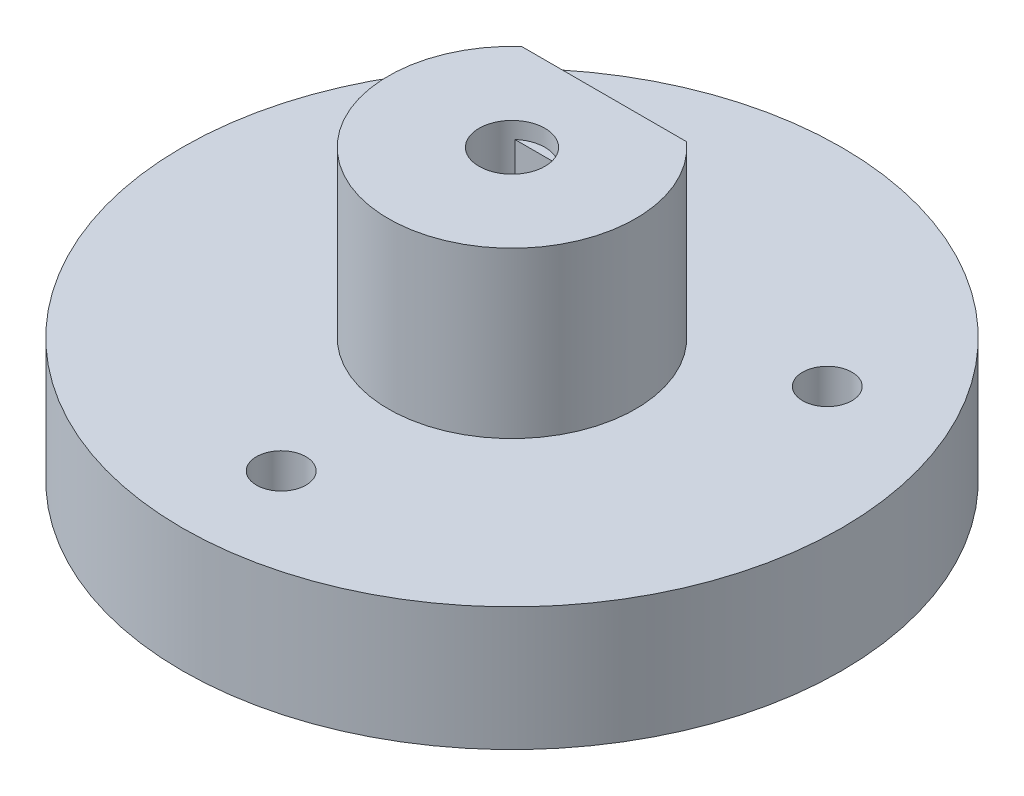
ISO-10303-21;
HEADER;
FILE_DESCRIPTION(('STEP AP214'),'2;1');
FILE_NAME('part.step','',(''),(''),'','','');
FILE_SCHEMA(('AUTOMOTIVE_DESIGN { 1 0 10303 214 1 1 1 1 }'));
ENDSEC;
DATA;
#1=APPLICATION_CONTEXT('core data for automotive mechanical design processes');
#2=APPLICATION_PROTOCOL_DEFINITION('international standard','automotive_design',2000,#1);
#3=PRODUCT_CONTEXT('',#1,'mechanical');
#4=PRODUCT('Part','Part','',(#3));
#5=PRODUCT_RELATED_PRODUCT_CATEGORY('part','',(#4));
#6=PRODUCT_DEFINITION_FORMATION('','',#4);
#7=PRODUCT_DEFINITION_CONTEXT('part definition',#1,'design');
#8=PRODUCT_DEFINITION('design','',#6,#7);
#9=PRODUCT_DEFINITION_SHAPE('','',#8);
#10=(LENGTH_UNIT() NAMED_UNIT(*) SI_UNIT(.MILLI.,.METRE.));
#11=(NAMED_UNIT(*) PLANE_ANGLE_UNIT() SI_UNIT($,.RADIAN.));
#12=(NAMED_UNIT(*) SI_UNIT($,.STERADIAN.) SOLID_ANGLE_UNIT());
#13=UNCERTAINTY_MEASURE_WITH_UNIT(LENGTH_MEASURE(1.E-05),#10,'distance_accuracy_value','');
#14=(GEOMETRIC_REPRESENTATION_CONTEXT(3) GLOBAL_UNCERTAINTY_ASSIGNED_CONTEXT((#13)) GLOBAL_UNIT_ASSIGNED_CONTEXT((#10,
#11,#12)) REPRESENTATION_CONTEXT('',''));
#15=CARTESIAN_POINT('',(0.,0.,0.));
#16=DIRECTION('',(0.,0.,1.));
#17=DIRECTION('',(1.,0.,0.));
#18=AXIS2_PLACEMENT_3D('',#15,#16,#17);
#19=CARTESIAN_POINT('',(-1.3228756555323,2.18492709363267,-1.5));
#20=DIRECTION('',(0.,0.,-1.));
#21=DIRECTION('',(-1.,0.,0.));
#22=AXIS2_PLACEMENT_3D('',#19,#20,#21);
#23=PLANE('',#22);
#24=DIRECTION('',(1.,0.,0.));
#25=VECTOR('',#24,1.);
#26=CARTESIAN_POINT('',(-1.3228756555323,16.5,-1.5));
#27=LINE('',#26,#25);
#28=CARTESIAN_POINT('',(-1.3228756555323,16.5,-1.5));
#29=VERTEX_POINT('',#28);
#30=CARTESIAN_POINT('',(1.3228756555323,16.5,-1.5));
#31=VERTEX_POINT('',#30);
#32=EDGE_CURVE('E130',#29,#31,#27,.T.);
#33=ORIENTED_EDGE('',*,*,#32,.F.);
#34=DIRECTION('',(0.,1.,0.));
#35=VECTOR('',#34,1.);
#36=CARTESIAN_POINT('',(-1.3228756555323,2.18492709363267,-1.5));
#37=LINE('',#36,#35);
#38=CARTESIAN_POINT('',(-1.32287565553229,13.8287682265918,-1.5));
#39=VERTEX_POINT('',#38);
#40=EDGE_CURVE('E146',#39,#29,#37,.T.);
#41=ORIENTED_EDGE('',*,*,#40,.F.);
#42=CARTESIAN_POINT('',(0.,12.5,-1.5));
#43=DIRECTION('',(0.,0.,-1.));
#44=DIRECTION('',(-1.,0.,0.));
#45=AXIS2_PLACEMENT_3D('',#42,#43,#44);
#46=CIRCLE('',#45,1.875);
#47=CARTESIAN_POINT('',(1.32287565553229,13.8287682265918,-1.5));
#48=VERTEX_POINT('',#47);
#49=EDGE_CURVE('E11',#39,#48,#46,.T.);
#50=ORIENTED_EDGE('',*,*,#49,.T.);
#51=DIRECTION('',(0.,1.,0.));
#52=VECTOR('',#51,1.);
#53=CARTESIAN_POINT('',(1.3228756555323,2.18492709363267,-1.5));
#54=LINE('',#53,#52);
#55=EDGE_CURVE('E145',#48,#31,#54,.T.);
#56=ORIENTED_EDGE('',*,*,#55,.T.);
#57=EDGE_LOOP('',(#33,#41,#50,#56));
#58=FACE_BOUND('',#57,.T.);
#59=ADVANCED_FACE('F39',(#58),#23,.F.);
#60=CARTESIAN_POINT('',(0.,7.5,0.));
#61=DIRECTION('',(0.,-1.,0.));
#62=DIRECTION('',(0.,0.,-1.));
#63=AXIS2_PLACEMENT_3D('',#60,#61,#62);
#64=CYLINDRICAL_SURFACE('',#63,20.);
#65=CARTESIAN_POINT('',(0.,7.5,0.));
#66=DIRECTION('',(0.,1.,0.));
#67=DIRECTION('',(0.,0.,1.));
#68=AXIS2_PLACEMENT_3D('',#65,#66,#67);
#69=CIRCLE('',#68,20.);
#70=CARTESIAN_POINT('',(0.,7.5,20.));
#71=VERTEX_POINT('',#70);
#72=EDGE_CURVE('E253',#71,#71,#69,.T.);
#73=ORIENTED_EDGE('',*,*,#72,.F.);
#74=EDGE_LOOP('',(#73));
#75=FACE_BOUND('',#74,.T.);
#76=CARTESIAN_POINT('',(0.,0.,0.));
#77=DIRECTION('',(0.,1.,0.));
#78=DIRECTION('',(0.,0.,1.));
#79=AXIS2_PLACEMENT_3D('',#76,#77,#78);
#80=CIRCLE('',#79,20.);
#81=CARTESIAN_POINT('',(0.,0.,20.));
#82=VERTEX_POINT('',#81);
#83=EDGE_CURVE('E248',#82,#82,#80,.T.);
#84=ORIENTED_EDGE('',*,*,#83,.T.);
#85=EDGE_LOOP('',(#84));
#86=FACE_BOUND('',#85,.T.);
#87=ADVANCED_FACE('F41',(#75,#86),#64,.T.);
#88=CARTESIAN_POINT('',(0.,7.5,0.));
#89=DIRECTION('',(0.,1.,0.));
#90=DIRECTION('',(0.,0.,1.));
#91=AXIS2_PLACEMENT_3D('',#88,#89,#90);
#92=PLANE('',#91);
#93=CARTESIAN_POINT('',(-12.1243556529822,7.5,-6.99999999999992));
#94=DIRECTION('',(0.,1.,0.));
#95=DIRECTION('',(0.,0.,1.));
#96=AXIS2_PLACEMENT_3D('',#93,#94,#95);
#97=CIRCLE('',#96,1.5);
#98=CARTESIAN_POINT('',(-12.1243556529822,7.5,-5.49999999999993));
#99=VERTEX_POINT('',#98);
#100=EDGE_CURVE('E265',#99,#99,#97,.T.);
#101=ORIENTED_EDGE('',*,*,#100,.F.);
#102=EDGE_LOOP('',(#101));
#103=FACE_BOUND('',#102,.T.);
#104=CARTESIAN_POINT('',(12.1243556529821,7.5,-7.00000000000154));
#105=DIRECTION('',(0.,1.,0.));
#106=DIRECTION('',(0.,0.,1.));
#107=AXIS2_PLACEMENT_3D('',#104,#105,#106);
#108=CIRCLE('',#107,1.5);
#109=CARTESIAN_POINT('',(12.1243556529821,7.5,-5.50000000000154));
#110=VERTEX_POINT('',#109);
#111=EDGE_CURVE('E542',#110,#110,#108,.T.);
#112=ORIENTED_EDGE('',*,*,#111,.F.);
#113=EDGE_LOOP('',(#112));
#114=FACE_BOUND('',#113,.T.);
#115=CARTESIAN_POINT('',(1.36099323779789E-12,7.5,13.9999999999993));
#116=DIRECTION('',(0.,1.,0.));
#117=DIRECTION('',(0.,0.,1.));
#118=AXIS2_PLACEMENT_3D('',#115,#116,#117);
#119=CIRCLE('',#118,1.49999999999999);
#120=CARTESIAN_POINT('',(1.36099323779789E-12,7.5,15.4999999999993));
#121=VERTEX_POINT('',#120);
#122=EDGE_CURVE('E139',#121,#121,#119,.T.);
#123=ORIENTED_EDGE('',*,*,#122,.F.);
#124=EDGE_LOOP('',(#123));
#125=FACE_BOUND('',#124,.T.);
#126=CARTESIAN_POINT('',(0.,7.5,0.));
#127=DIRECTION('',(0.,1.,0.));
#128=DIRECTION('',(0.,0.,1.));
#129=AXIS2_PLACEMENT_3D('',#126,#127,#128);
#130=CIRCLE('',#129,7.5);
#131=CARTESIAN_POINT('',(-5.,7.5,-5.59016994374947));
#132=VERTEX_POINT('',#131);
#133=CARTESIAN_POINT('',(5.,7.5,-5.59016994374947));
#134=VERTEX_POINT('',#133);
#135=EDGE_CURVE('E249',#132,#134,#130,.T.);
#136=ORIENTED_EDGE('',*,*,#135,.F.);
#137=DIRECTION('',(1.,0.,0.));
#138=VECTOR('',#137,1.);
#139=CARTESIAN_POINT('',(-5.,7.5,-5.59016994374947));
#140=LINE('',#139,#138);
#141=EDGE_CURVE('E231',#132,#134,#140,.T.);
#142=ORIENTED_EDGE('',*,*,#141,.T.);
#143=EDGE_LOOP('',(#136,#142));
#144=FACE_BOUND('',#143,.T.);
#145=ORIENTED_EDGE('',*,*,#72,.T.);
#146=EDGE_LOOP('',(#145));
#147=FACE_BOUND('',#146,.T.);
#148=ADVANCED_FACE('F322',(#103,#114,#125,#144,#147),#92,.T.);
#149=CARTESIAN_POINT('',(0.,0.,0.));
#150=DIRECTION('',(0.,1.,0.));
#151=DIRECTION('',(0.,0.,1.));
#152=AXIS2_PLACEMENT_3D('',#149,#150,#151);
#153=PLANE('',#152);
#154=CARTESIAN_POINT('',(-12.1243556529822,0.,-6.99999999999992));
#155=DIRECTION('',(0.,1.,0.));
#156=DIRECTION('',(0.,0.,1.));
#157=AXIS2_PLACEMENT_3D('',#154,#155,#156);
#158=CIRCLE('',#157,1.5);
#159=CARTESIAN_POINT('',(-12.1243556529822,0.,-5.49999999999993));
#160=VERTEX_POINT('',#159);
#161=EDGE_CURVE('E43',#160,#160,#158,.T.);
#162=ORIENTED_EDGE('',*,*,#161,.T.);
#163=EDGE_LOOP('',(#162));
#164=FACE_BOUND('',#163,.T.);
#165=CARTESIAN_POINT('',(12.1243556529821,0.,-7.00000000000154));
#166=DIRECTION('',(0.,1.,0.));
#167=DIRECTION('',(0.,0.,1.));
#168=AXIS2_PLACEMENT_3D('',#165,#166,#167);
#169=CIRCLE('',#168,1.5);
#170=CARTESIAN_POINT('',(12.1243556529821,0.,-5.50000000000154));
#171=VERTEX_POINT('',#170);
#172=EDGE_CURVE('E264',#171,#171,#169,.T.);
#173=ORIENTED_EDGE('',*,*,#172,.T.);
#174=EDGE_LOOP('',(#173));
#175=FACE_BOUND('',#174,.T.);
#176=CARTESIAN_POINT('',(1.36099323779789E-12,0.,13.9999999999993));
#177=DIRECTION('',(0.,1.,0.));
#178=DIRECTION('',(0.,0.,1.));
#179=AXIS2_PLACEMENT_3D('',#176,#177,#178);
#180=CIRCLE('',#179,1.49999999999999);
#181=CARTESIAN_POINT('',(1.36099323779789E-12,0.,15.4999999999993));
#182=VERTEX_POINT('',#181);
#183=EDGE_CURVE('E261',#182,#182,#180,.T.);
#184=ORIENTED_EDGE('',*,*,#183,.T.);
#185=EDGE_LOOP('',(#184));
#186=FACE_BOUND('',#185,.T.);
#187=ORIENTED_EDGE('',*,*,#83,.F.);
#188=EDGE_LOOP('',(#187));
#189=FACE_BOUND('',#188,.T.);
#190=ADVANCED_FACE('F327',(#164,#175,#186,#189),#153,.F.);
#191=CARTESIAN_POINT('',(0.,17.5,0.));
#192=DIRECTION('',(0.,-1.,0.));
#193=DIRECTION('',(0.,0.,-1.));
#194=AXIS2_PLACEMENT_3D('',#191,#192,#193);
#195=CYLINDRICAL_SURFACE('',#194,7.5);
#196=CARTESIAN_POINT('',(0.,17.5,0.));
#197=DIRECTION('',(0.,1.,0.));
#198=DIRECTION('',(0.,0.,1.));
#199=AXIS2_PLACEMENT_3D('',#196,#197,#198);
#200=CIRCLE('',#199,7.5);
#201=CARTESIAN_POINT('',(-5.,17.5,-5.59016994374947));
#202=VERTEX_POINT('',#201);
#203=CARTESIAN_POINT('',(5.,17.5,-5.59016994374947));
#204=VERTEX_POINT('',#203);
#205=EDGE_CURVE('E242',#202,#204,#200,.T.);
#206=ORIENTED_EDGE('',*,*,#205,.F.);
#207=DIRECTION('',(0.,1.,0.));
#208=VECTOR('',#207,1.);
#209=CARTESIAN_POINT('',(-5.,7.5,-5.59016994374947));
#210=LINE('',#209,#208);
#211=EDGE_CURVE('E235',#132,#202,#210,.T.);
#212=ORIENTED_EDGE('',*,*,#211,.F.);
#213=ORIENTED_EDGE('',*,*,#135,.T.);
#214=DIRECTION('',(0.,1.,0.));
#215=VECTOR('',#214,1.);
#216=CARTESIAN_POINT('',(5.,7.5,-5.59016994374947));
#217=LINE('',#216,#215);
#218=EDGE_CURVE('E238',#134,#204,#217,.T.);
#219=ORIENTED_EDGE('',*,*,#218,.T.);
#220=EDGE_LOOP('',(#206,#212,#213,#219));
#221=FACE_BOUND('',#220,.T.);
#222=ADVANCED_FACE('F335',(#221),#195,.T.);
#223=CARTESIAN_POINT('',(0.,17.5,0.));
#224=DIRECTION('',(0.,1.,0.));
#225=DIRECTION('',(0.,0.,1.));
#226=AXIS2_PLACEMENT_3D('',#223,#224,#225);
#227=PLANE('',#226);
#228=CARTESIAN_POINT('',(0.,17.5,0.));
#229=DIRECTION('',(0.,1.,0.));
#230=DIRECTION('',(0.,0.,1.));
#231=AXIS2_PLACEMENT_3D('',#228,#229,#230);
#232=CIRCLE('',#231,2.);
#233=CARTESIAN_POINT('',(0.,17.5,2.));
#234=VERTEX_POINT('',#233);
#235=EDGE_CURVE('E151',#234,#234,#232,.T.);
#236=ORIENTED_EDGE('',*,*,#235,.F.);
#237=EDGE_LOOP('',(#236));
#238=FACE_BOUND('',#237,.T.);
#239=DIRECTION('',(1.,0.,0.));
#240=VECTOR('',#239,1.);
#241=CARTESIAN_POINT('',(-5.,17.5,-5.59016994374947));
#242=LINE('',#241,#240);
#243=EDGE_CURVE('E216',#202,#204,#242,.T.);
#244=ORIENTED_EDGE('',*,*,#243,.F.);
#245=ORIENTED_EDGE('',*,*,#205,.T.);
#246=EDGE_LOOP('',(#244,#245));
#247=FACE_BOUND('',#246,.T.);
#248=ADVANCED_FACE('F339',(#238,#247),#227,.T.);
#249=CARTESIAN_POINT('',(-5.,7.5,-5.59016994374947));
#250=DIRECTION('',(0.,0.,1.));
#251=DIRECTION('',(1.,0.,0.));
#252=AXIS2_PLACEMENT_3D('',#249,#250,#251);
#253=PLANE('',#252);
#254=DIRECTION('',(-0.866025403784439,0.499999999999999,0.));
#255=VECTOR('',#254,1.);
#256=CARTESIAN_POINT('',(0.,8.45854811567262,-5.59016994374947));
#257=LINE('',#256,#255);
#258=CARTESIAN_POINT('',(0.,8.45854811567262,-5.59016994374947));
#259=VERTEX_POINT('',#258);
#260=CARTESIAN_POINT('',(-3.5,10.4792740578363,-5.59016994374947));
#261=VERTEX_POINT('',#260);
#262=EDGE_CURVE('E194',#259,#261,#257,.T.);
#263=ORIENTED_EDGE('',*,*,#262,.F.);
#264=DIRECTION('',(-0.866025403784438,-0.500000000000001,0.));
#265=VECTOR('',#264,1.);
#266=CARTESIAN_POINT('',(3.50000000000001,10.4792740578363,-5.59016994374947));
#267=LINE('',#266,#265);
#268=CARTESIAN_POINT('',(3.50000000000001,10.4792740578363,-5.59016994374947));
#269=VERTEX_POINT('',#268);
#270=EDGE_CURVE('E65',#269,#259,#267,.T.);
#271=ORIENTED_EDGE('',*,*,#270,.F.);
#272=DIRECTION('',(0.,-1.,0.));
#273=VECTOR('',#272,1.);
#274=CARTESIAN_POINT('',(3.5,14.5207259421637,-5.59016994374947));
#275=LINE('',#274,#273);
#276=CARTESIAN_POINT('',(3.5,14.5207259421637,-5.59016994374947));
#277=VERTEX_POINT('',#276);
#278=EDGE_CURVE('E171',#277,#269,#275,.T.);
#279=ORIENTED_EDGE('',*,*,#278,.F.);
#280=DIRECTION('',(0.866025403784439,-0.499999999999999,0.));
#281=VECTOR('',#280,1.);
#282=CARTESIAN_POINT('',(0.,16.5414518843274,-5.59016994374947));
#283=LINE('',#282,#281);
#284=CARTESIAN_POINT('',(0.,16.5414518843274,-5.59016994374947));
#285=VERTEX_POINT('',#284);
#286=EDGE_CURVE('E206',#285,#277,#283,.T.);
#287=ORIENTED_EDGE('',*,*,#286,.F.);
#288=DIRECTION('',(0.866025403784438,0.500000000000001,0.));
#289=VECTOR('',#288,1.);
#290=CARTESIAN_POINT('',(-3.5,14.5207259421637,-5.59016994374947));
#291=LINE('',#290,#289);
#292=CARTESIAN_POINT('',(-3.5,14.5207259421637,-5.59016994374947));
#293=VERTEX_POINT('',#292);
#294=EDGE_CURVE('E202',#293,#285,#291,.T.);
#295=ORIENTED_EDGE('',*,*,#294,.F.);
#296=DIRECTION('',(0.,1.,0.));
#297=VECTOR('',#296,1.);
#298=CARTESIAN_POINT('',(-3.5,10.4792740578363,-5.59016994374947));
#299=LINE('',#298,#297);
#300=EDGE_CURVE('E198',#261,#293,#299,.T.);
#301=ORIENTED_EDGE('',*,*,#300,.F.);
#302=EDGE_LOOP('',(#263,#271,#279,#287,#295,#301));
#303=FACE_BOUND('',#302,.T.);
#304=ORIENTED_EDGE('',*,*,#243,.T.);
#305=ORIENTED_EDGE('',*,*,#218,.F.);
#306=ORIENTED_EDGE('',*,*,#141,.F.);
#307=ORIENTED_EDGE('',*,*,#211,.T.);
#308=EDGE_LOOP('',(#304,#305,#306,#307));
#309=FACE_BOUND('',#308,.T.);
#310=ADVANCED_FACE('F345',(#303,#309),#253,.F.);
#311=CARTESIAN_POINT('',(3.50000000000001,10.4792740578363,-2.59016994374947));
#312=DIRECTION('',(0.500000000000001,-0.866025403784438,0.));
#313=DIRECTION('',(0.866025403784438,0.500000000000001,0.));
#314=AXIS2_PLACEMENT_3D('',#311,#312,#313);
#315=PLANE('',#314);
#316=ORIENTED_EDGE('',*,*,#270,.T.);
#317=DIRECTION('',(0.,0.,-1.));
#318=VECTOR('',#317,1.);
#319=CARTESIAN_POINT('',(0.,8.45854811567262,-2.59016994374947));
#320=LINE('',#319,#318);
#321=CARTESIAN_POINT('',(0.,8.45854811567262,-2.59016994374947));
#322=VERTEX_POINT('',#321);
#323=EDGE_CURVE('E191',#322,#259,#320,.T.);
#324=ORIENTED_EDGE('',*,*,#323,.F.);
#325=DIRECTION('',(-0.866025403784438,-0.500000000000001,0.));
#326=VECTOR('',#325,1.);
#327=CARTESIAN_POINT('',(3.50000000000001,10.4792740578363,-2.59016994374947));
#328=LINE('',#327,#326);
#329=CARTESIAN_POINT('',(3.50000000000001,10.4792740578363,-2.59016994374947));
#330=VERTEX_POINT('',#329);
#331=EDGE_CURVE('E166',#330,#322,#328,.T.);
#332=ORIENTED_EDGE('',*,*,#331,.F.);
#333=DIRECTION('',(0.,0.,-1.));
#334=VECTOR('',#333,1.);
#335=CARTESIAN_POINT('',(3.50000000000001,10.4792740578363,-2.59016994374947));
#336=LINE('',#335,#334);
#337=EDGE_CURVE('E213',#330,#269,#336,.T.);
#338=ORIENTED_EDGE('',*,*,#337,.T.);
#339=EDGE_LOOP('',(#316,#324,#332,#338));
#340=FACE_BOUND('',#339,.T.);
#341=ADVANCED_FACE('F349',(#340),#315,.F.);
#342=CARTESIAN_POINT('',(3.5,14.5207259421637,-2.59016994374947));
#343=DIRECTION('',(1.,0.,0.));
#344=DIRECTION('',(0.,1.,0.));
#345=AXIS2_PLACEMENT_3D('',#342,#343,#344);
#346=PLANE('',#345);
#347=ORIENTED_EDGE('',*,*,#278,.T.);
#348=ORIENTED_EDGE('',*,*,#337,.F.);
#349=DIRECTION('',(0.,-1.,0.));
#350=VECTOR('',#349,1.);
#351=CARTESIAN_POINT('',(3.5,14.5207259421637,-2.59016994374947));
#352=LINE('',#351,#350);
#353=CARTESIAN_POINT('',(3.5,14.5207259421637,-2.59016994374947));
#354=VERTEX_POINT('',#353);
#355=EDGE_CURVE('E187',#354,#330,#352,.T.);
#356=ORIENTED_EDGE('',*,*,#355,.F.);
#357=DIRECTION('',(0.,0.,-1.));
#358=VECTOR('',#357,1.);
#359=CARTESIAN_POINT('',(3.5,14.5207259421637,-2.59016994374947));
#360=LINE('',#359,#358);
#361=EDGE_CURVE('E217',#354,#277,#360,.T.);
#362=ORIENTED_EDGE('',*,*,#361,.T.);
#363=EDGE_LOOP('',(#347,#348,#356,#362));
#364=FACE_BOUND('',#363,.T.);
#365=ADVANCED_FACE('F353',(#364),#346,.F.);
#366=CARTESIAN_POINT('',(0.,16.5414518843274,-2.59016994374947));
#367=DIRECTION('',(0.5,0.866025403784439,0.));
#368=DIRECTION('',(-0.866025403784439,0.5,0.));
#369=AXIS2_PLACEMENT_3D('',#366,#367,#368);
#370=PLANE('',#369);
#371=ORIENTED_EDGE('',*,*,#286,.T.);
#372=ORIENTED_EDGE('',*,*,#361,.F.);
#373=DIRECTION('',(0.866025403784439,-0.499999999999999,0.));
#374=VECTOR('',#373,1.);
#375=CARTESIAN_POINT('',(0.,16.5414518843274,-2.59016994374947));
#376=LINE('',#375,#374);
#377=CARTESIAN_POINT('',(0.,16.5414518843274,-2.59016994374947));
#378=VERTEX_POINT('',#377);
#379=EDGE_CURVE('E183',#378,#354,#376,.T.);
#380=ORIENTED_EDGE('',*,*,#379,.F.);
#381=DIRECTION('',(0.,0.,-1.));
#382=VECTOR('',#381,1.);
#383=CARTESIAN_POINT('',(0.,16.5414518843274,-2.59016994374947));
#384=LINE('',#383,#382);
#385=EDGE_CURVE('E220',#378,#285,#384,.T.);
#386=ORIENTED_EDGE('',*,*,#385,.T.);
#387=EDGE_LOOP('',(#371,#372,#380,#386));
#388=FACE_BOUND('',#387,.T.);
#389=ADVANCED_FACE('F365',(#388),#370,.F.);
#390=CARTESIAN_POINT('',(-3.5,14.5207259421637,-2.59016994374947));
#391=DIRECTION('',(-0.500000000000001,0.866025403784438,0.));
#392=DIRECTION('',(-0.866025403784438,-0.500000000000001,0.));
#393=AXIS2_PLACEMENT_3D('',#390,#391,#392);
#394=PLANE('',#393);
#395=ORIENTED_EDGE('',*,*,#294,.T.);
#396=ORIENTED_EDGE('',*,*,#385,.F.);
#397=DIRECTION('',(0.866025403784438,0.500000000000001,0.));
#398=VECTOR('',#397,1.);
#399=CARTESIAN_POINT('',(-3.5,14.5207259421637,-2.59016994374947));
#400=LINE('',#399,#398);
#401=CARTESIAN_POINT('',(-3.5,14.5207259421637,-2.59016994374947));
#402=VERTEX_POINT('',#401);
#403=EDGE_CURVE('E179',#402,#378,#400,.T.);
#404=ORIENTED_EDGE('',*,*,#403,.F.);
#405=DIRECTION('',(0.,0.,-1.));
#406=VECTOR('',#405,1.);
#407=CARTESIAN_POINT('',(-3.5,14.5207259421637,-2.59016994374947));
#408=LINE('',#407,#406);
#409=EDGE_CURVE('E223',#402,#293,#408,.T.);
#410=ORIENTED_EDGE('',*,*,#409,.T.);
#411=EDGE_LOOP('',(#395,#396,#404,#410));
#412=FACE_BOUND('',#411,.T.);
#413=ADVANCED_FACE('F361',(#412),#394,.F.);
#414=CARTESIAN_POINT('',(-3.5,10.4792740578363,-2.59016994374947));
#415=DIRECTION('',(-1.,0.,0.));
#416=DIRECTION('',(0.,-1.,0.));
#417=AXIS2_PLACEMENT_3D('',#414,#415,#416);
#418=PLANE('',#417);
#419=ORIENTED_EDGE('',*,*,#300,.T.);
#420=ORIENTED_EDGE('',*,*,#409,.F.);
#421=DIRECTION('',(0.,1.,0.));
#422=VECTOR('',#421,1.);
#423=CARTESIAN_POINT('',(-3.5,10.4792740578363,-2.59016994374947));
#424=LINE('',#423,#422);
#425=CARTESIAN_POINT('',(-3.5,10.4792740578363,-2.59016994374947));
#426=VERTEX_POINT('',#425);
#427=EDGE_CURVE('E175',#426,#402,#424,.T.);
#428=ORIENTED_EDGE('',*,*,#427,.F.);
#429=DIRECTION('',(0.,0.,-1.));
#430=VECTOR('',#429,1.);
#431=CARTESIAN_POINT('',(-3.5,10.4792740578363,-2.59016994374947));
#432=LINE('',#431,#430);
#433=EDGE_CURVE('E226',#426,#261,#432,.T.);
#434=ORIENTED_EDGE('',*,*,#433,.T.);
#435=EDGE_LOOP('',(#419,#420,#428,#434));
#436=FACE_BOUND('',#435,.T.);
#437=ADVANCED_FACE('F357',(#436),#418,.F.);
#438=CARTESIAN_POINT('',(0.,8.45854811567262,-2.59016994374947));
#439=DIRECTION('',(-0.499999999999999,-0.866025403784439,0.));
#440=DIRECTION('',(0.866025403784439,-0.499999999999999,0.));
#441=AXIS2_PLACEMENT_3D('',#438,#439,#440);
#442=PLANE('',#441);
#443=ORIENTED_EDGE('',*,*,#262,.T.);
#444=ORIENTED_EDGE('',*,*,#433,.F.);
#445=DIRECTION('',(-0.866025403784439,0.499999999999999,0.));
#446=VECTOR('',#445,1.);
#447=CARTESIAN_POINT('',(0.,8.45854811567262,-2.59016994374947));
#448=LINE('',#447,#446);
#449=EDGE_CURVE('E170',#322,#426,#448,.T.);
#450=ORIENTED_EDGE('',*,*,#449,.F.);
#451=ORIENTED_EDGE('',*,*,#323,.T.);
#452=EDGE_LOOP('',(#443,#444,#450,#451));
#453=FACE_BOUND('',#452,.T.);
#454=ADVANCED_FACE('F354',(#453),#442,.F.);
#455=CARTESIAN_POINT('',(0.,0.,-2.59016994374947));
#456=DIRECTION('',(0.,0.,-1.));
#457=DIRECTION('',(-1.,0.,0.));
#458=AXIS2_PLACEMENT_3D('',#455,#456,#457);
#459=PLANE('',#458);
#460=CARTESIAN_POINT('',(0.,12.5,-2.59016994374947));
#461=DIRECTION('',(0.,0.,-1.));
#462=DIRECTION('',(-1.,0.,0.));
#463=AXIS2_PLACEMENT_3D('',#460,#461,#462);
#464=CIRCLE('',#463,1.875);
#465=CARTESIAN_POINT('',(-1.875,12.5,-2.59016994374947));
#466=VERTEX_POINT('',#465);
#467=EDGE_CURVE('E272',#466,#466,#464,.T.);
#468=ORIENTED_EDGE('',*,*,#467,.F.);
#469=EDGE_LOOP('',(#468));
#470=FACE_BOUND('',#469,.T.);
#471=ORIENTED_EDGE('',*,*,#331,.T.);
#472=ORIENTED_EDGE('',*,*,#449,.T.);
#473=ORIENTED_EDGE('',*,*,#427,.T.);
#474=ORIENTED_EDGE('',*,*,#403,.T.);
#475=ORIENTED_EDGE('',*,*,#379,.T.);
#476=ORIENTED_EDGE('',*,*,#355,.T.);
#477=EDGE_LOOP('',(#471,#472,#473,#474,#475,#476));
#478=FACE_BOUND('',#477,.T.);
#479=ADVANCED_FACE('F316',(#470,#478),#459,.T.);
#480=CARTESIAN_POINT('',(0.,2.18492709363267,0.));
#481=DIRECTION('',(0.,1.,0.));
#482=DIRECTION('',(0.,0.,1.));
#483=AXIS2_PLACEMENT_3D('',#480,#481,#482);
#484=CYLINDRICAL_SURFACE('',#483,2.);
#485=ORIENTED_EDGE('',*,*,#235,.T.);
#486=EDGE_LOOP('',(#485));
#487=FACE_BOUND('',#486,.T.);
#488=ORIENTED_EDGE('',*,*,#40,.T.);
#489=CARTESIAN_POINT('',(0.,16.5,0.));
#490=DIRECTION('',(0.,1.,0.));
#491=DIRECTION('',(0.,0.,1.));
#492=AXIS2_PLACEMENT_3D('',#489,#490,#491);
#493=CIRCLE('',#492,2.);
#494=EDGE_CURVE('E133',#31,#29,#493,.T.);
#495=ORIENTED_EDGE('',*,*,#494,.F.);
#496=ORIENTED_EDGE('',*,*,#55,.F.);
#497=CARTESIAN_POINT('',(1.32287565553229,13.8287682265918,-1.5));
#498=CARTESIAN_POINT('',(1.37053828223241,13.7812643063997,-1.45797719405252));
#499=CARTESIAN_POINT('',(1.41507707968952,13.7318641139541,-1.41465042667909));
#500=CARTESIAN_POINT('',(1.49812561260594,13.6294385235822,-1.32638041172368));
#501=CARTESIAN_POINT('',(1.53662949715042,13.5764096783031,-1.28143564674255));
#502=CARTESIAN_POINT('',(1.60818088890621,13.4663013053375,-1.19043979034085));
#503=CARTESIAN_POINT('',(1.6411540223503,13.4091793650433,-1.14438189289642));
#504=CARTESIAN_POINT('',(1.70113678206955,13.291288854324,-1.05313766443209));
#505=CARTESIAN_POINT('',(1.72815186791995,13.2305236878184,-1.00795057041357));
#506=CARTESIAN_POINT('',(1.77083875706235,13.1184718806861,-0.930395167611206));
#507=CARTESIAN_POINT('',(1.78769758019431,13.0680696972913,-0.897405583033618));
#508=CARTESIAN_POINT('',(1.81752995044654,12.9638384627507,-0.835319004736626));
#509=CARTESIAN_POINT('',(1.83051059794207,12.910015895757,-0.806214951911342));
#510=CARTESIAN_POINT('',(1.84902739261948,12.8136953792487,-0.76256005458334));
#511=CARTESIAN_POINT('',(1.85563026472134,12.7722407262571,-0.74621556148205));
#512=CARTESIAN_POINT('',(1.86612571083644,12.6871420618842,-0.719571745767211));
#513=CARTESIAN_POINT('',(1.87002772436288,12.6435062530599,-0.709251388796148));
#514=CARTESIAN_POINT('',(1.87438138916011,12.5612928351613,-0.697660250817065));
#515=CARTESIAN_POINT('',(1.87525118775515,12.5228988522031,-0.695294568143516));
#516=CARTESIAN_POINT('',(1.87462212156375,12.4462764096833,-0.696987789652035));
#517=CARTESIAN_POINT('',(1.87312288926745,12.4080479767262,-0.701047690640759));
#518=CARTESIAN_POINT('',(1.86712264621733,12.3214053421594,-0.71689675114061));
#519=CARTESIAN_POINT('',(1.86184876272713,12.2734206350637,-0.730657599406197));
#520=CARTESIAN_POINT('',(1.84813435216521,12.180204508786,-0.764676888124884));
#521=CARTESIAN_POINT('',(1.83967828961884,12.1349878835646,-0.784967133675177));
#522=CARTESIAN_POINT('',(1.81978409532719,12.0459660060591,-0.830067102031584));
#523=CARTESIAN_POINT('',(1.80826891374077,12.0022360076143,-0.854987707330137));
#524=CARTESIAN_POINT('',(1.78262424631307,11.9170298398421,-0.907251302291443));
#525=CARTESIAN_POINT('',(1.76849191350137,11.8755561891797,-0.934596912860052));
#526=CARTESIAN_POINT('',(1.72231117773692,11.7537833231121,-1.01868012426052));
#527=CARTESIAN_POINT('',(1.68650544861684,11.6762446774125,-1.07739958396639));
#528=CARTESIAN_POINT('',(1.62436267925403,11.5624206296179,-1.16743022860063));
#529=CARTESIAN_POINT('',(1.60156139961704,11.5239749154777,-1.19856404858635));
#530=CARTESIAN_POINT('',(1.55317691077656,11.4486804678315,-1.26062813495217));
#531=CARTESIAN_POINT('',(1.52759361051076,11.4118317866555,-1.29155839463409));
#532=CARTESIAN_POINT('',(1.47380476992711,11.340033903049,-1.3526064683046));
#533=CARTESIAN_POINT('',(1.44562069404987,11.3050723673009,-1.38272867689846));
#534=CARTESIAN_POINT('',(1.38640110847743,11.2368486035011,-1.4420991980774));
#535=CARTESIAN_POINT('',(1.35536498898132,11.2035867412364,-1.47134732199292));
#536=CARTESIAN_POINT('',(1.32287565553229,11.1712317734082,-1.5));
#537=B_SPLINE_CURVE_WITH_KNOTS('',3,(#497,#498,#499,#500,#501,#502,#503,#504,#505,#506,#507,
#508,#509,#510,#511,#512,#513,#514,#515,#516,#517,#518,#519,#520,#521,#522,#523,#524,#525,#526,
#527,#528,#529,#530,#531,#532,#533,#534,#535,#536),.UNSPECIFIED.,.F.,.F.,(4,2,2,2,2,2,2,2,2,2,2,
2,2,2,2,2,2,2,2,4),(0.,0.237842970957552,0.475915125664067,0.716968849355863,0.957800760453072,
1.14525148542453,1.33235688211981,1.46712750358024,1.60142468985233,1.71625546537332,
1.83110405644341,1.98080538644243,2.13124724833316,2.28591236734963,2.44074673202184,
2.75080925407163,2.91416557774578,3.07752725008055,3.23964424246999,3.40179597841453),.UNSPECIFIED.);
#538=CARTESIAN_POINT('',(1.3228756555323,11.1712317734082,-1.5));
#539=VERTEX_POINT('',#538);
#540=EDGE_CURVE('E157',#48,#539,#537,.T.);
#541=ORIENTED_EDGE('',*,*,#540,.T.);
#542=CARTESIAN_POINT('',(1.32287565553229,7.5,-1.5));
#543=VERTEX_POINT('',#542);
#544=EDGE_CURVE('E150',#543,#539,#54,.T.);
#545=ORIENTED_EDGE('',*,*,#544,.F.);
#546=CARTESIAN_POINT('',(0.,7.5,0.));
#547=DIRECTION('',(0.,1.,0.));
#548=DIRECTION('',(0.,0.,1.));
#549=AXIS2_PLACEMENT_3D('',#546,#547,#548);
#550=CIRCLE('',#549,2.);
#551=CARTESIAN_POINT('',(-1.3228756555323,7.5,-1.5));
#552=VERTEX_POINT('',#551);
#553=EDGE_CURVE('E165',#543,#552,#550,.F.);
#554=ORIENTED_EDGE('',*,*,#553,.T.);
#555=CARTESIAN_POINT('',(-1.3228756555323,11.1712317734082,-1.5));
#556=VERTEX_POINT('',#555);
#557=EDGE_CURVE('E161',#552,#556,#37,.T.);
#558=ORIENTED_EDGE('',*,*,#557,.T.);
#559=CARTESIAN_POINT('',(-1.32287565553229,11.1712317734082,-1.5));
#560=CARTESIAN_POINT('',(-1.37053828223241,11.2187356936003,-1.45797719405252));
#561=CARTESIAN_POINT('',(-1.41507707968952,11.2681358860459,-1.41465042667909));
#562=CARTESIAN_POINT('',(-1.49812561260594,11.3705614764178,-1.32638041172368));
#563=CARTESIAN_POINT('',(-1.53662949715042,11.4235903216969,-1.28143564674255));
#564=CARTESIAN_POINT('',(-1.60818088890621,11.5336986946625,-1.19043979034085));
#565=CARTESIAN_POINT('',(-1.6411540223503,11.5908206349566,-1.14438189289642));
#566=CARTESIAN_POINT('',(-1.70113678206955,11.708711145676,-1.05313766443209));
#567=CARTESIAN_POINT('',(-1.72815186791995,11.7694763121816,-1.00795057041357));
#568=CARTESIAN_POINT('',(-1.77083875706235,11.8815281193139,-0.930395167611206));
#569=CARTESIAN_POINT('',(-1.78769758019431,11.9319303027087,-0.897405583033618));
#570=CARTESIAN_POINT('',(-1.81752995044654,12.0361615372493,-0.835319004736626));
#571=CARTESIAN_POINT('',(-1.83051059794207,12.089984104243,-0.806214951911342));
#572=CARTESIAN_POINT('',(-1.84902739261948,12.1863046207513,-0.76256005458334));
#573=CARTESIAN_POINT('',(-1.85563026472134,12.2277592737429,-0.74621556148205));
#574=CARTESIAN_POINT('',(-1.86612571083644,12.3128579381158,-0.719571745767211));
#575=CARTESIAN_POINT('',(-1.87002772436288,12.3564937469401,-0.709251388796147));
#576=CARTESIAN_POINT('',(-1.87438138916011,12.4387071648387,-0.697660250817064));
#577=CARTESIAN_POINT('',(-1.87525118775515,12.4771011477969,-0.695294568143516));
#578=CARTESIAN_POINT('',(-1.87462212156375,12.5537235903167,-0.696987789652036));
#579=CARTESIAN_POINT('',(-1.87312288926745,12.5919520232738,-0.70104769064076));
#580=CARTESIAN_POINT('',(-1.86712264621733,12.6785946578406,-0.716896751140611));
#581=CARTESIAN_POINT('',(-1.86184876272713,12.7265793649363,-0.730657599406198));
#582=CARTESIAN_POINT('',(-1.84813435216521,12.819795491214,-0.764676888124885));
#583=CARTESIAN_POINT('',(-1.83967828961884,12.8650121164354,-0.784967133675177));
#584=CARTESIAN_POINT('',(-1.81978409532719,12.9540339939409,-0.830067102031584));
#585=CARTESIAN_POINT('',(-1.80826891374077,12.9977639923857,-0.854987707330137));
#586=CARTESIAN_POINT('',(-1.78262424631307,13.0829701601579,-0.907251302291442));
#587=CARTESIAN_POINT('',(-1.76849191350137,13.1244438108203,-0.934596912860051));
#588=CARTESIAN_POINT('',(-1.72231117773692,13.2462166768879,-1.01868012426052));
#589=CARTESIAN_POINT('',(-1.68650544861685,13.3237553225875,-1.07739958396639));
#590=CARTESIAN_POINT('',(-1.62436267925403,13.4375793703821,-1.16743022860062));
#591=CARTESIAN_POINT('',(-1.60156139961704,13.4760250845223,-1.19856404858635));
#592=CARTESIAN_POINT('',(-1.55317691077656,13.5513195321685,-1.26062813495217));
#593=CARTESIAN_POINT('',(-1.52759361051077,13.5881682133445,-1.29155839463409));
#594=CARTESIAN_POINT('',(-1.47380476992711,13.659966096951,-1.3526064683046));
#595=CARTESIAN_POINT('',(-1.44562069404987,13.6949276326991,-1.38272867689846));
#596=CARTESIAN_POINT('',(-1.38640110847743,13.7631513964989,-1.4420991980774));
#597=CARTESIAN_POINT('',(-1.35536498898132,13.7964132587636,-1.47134732199292));
#598=CARTESIAN_POINT('',(-1.3228756555323,13.8287682265918,-1.5));
#599=B_SPLINE_CURVE_WITH_KNOTS('',3,(#559,#560,#561,#562,#563,#564,#565,#566,#567,#568,#569,
#570,#571,#572,#573,#574,#575,#576,#577,#578,#579,#580,#581,#582,#583,#584,#585,#586,#587,#588,
#589,#590,#591,#592,#593,#594,#595,#596,#597,#598),.UNSPECIFIED.,.F.,.F.,(4,2,2,2,2,2,2,2,2,2,2,
2,2,2,2,2,2,2,2,4),(0.,0.237842970957552,0.475915125664068,0.716968849355863,0.957800760453073,
1.14525148542453,1.33235688211981,1.46712750358024,1.60142468985233,1.71625546537332,
1.83110405644341,1.98080538644243,2.13124724833315,2.28591236734963,2.44074673202184,
2.75080925407163,2.91416557774578,3.07752725008055,3.23964424246999,3.40179597841453),.UNSPECIFIED.);
#600=EDGE_CURVE('E57',#556,#39,#599,.T.);
#601=ORIENTED_EDGE('',*,*,#600,.T.);
#602=EDGE_LOOP('',(#488,#495,#496,#541,#545,#554,#558,#601));
#603=FACE_BOUND('',#602,.T.);
#604=ADVANCED_FACE('F143',(#487,#603),#484,.F.);
#605=ORIENTED_EDGE('',*,*,#544,.T.);
#606=EDGE_CURVE('E49',#539,#556,#46,.T.);
#607=ORIENTED_EDGE('',*,*,#606,.T.);
#608=ORIENTED_EDGE('',*,*,#557,.F.);
#609=DIRECTION('',(1.,0.,0.));
#610=VECTOR('',#609,1.);
#611=CARTESIAN_POINT('',(-1.3228756555323,7.5,-1.5));
#612=LINE('',#611,#610);
#613=EDGE_CURVE('E162',#552,#543,#612,.T.);
#614=ORIENTED_EDGE('',*,*,#613,.T.);
#615=EDGE_LOOP('',(#605,#607,#608,#614));
#616=FACE_BOUND('',#615,.T.);
#617=ADVANCED_FACE('F309',(#616),#23,.F.);
#618=CARTESIAN_POINT('',(0.,7.5,0.));
#619=DIRECTION('',(0.,1.,0.));
#620=DIRECTION('',(0.,0.,1.));
#621=AXIS2_PLACEMENT_3D('',#618,#619,#620);
#622=PLANE('',#621);
#623=ORIENTED_EDGE('',*,*,#553,.F.);
#624=ORIENTED_EDGE('',*,*,#613,.F.);
#625=EDGE_LOOP('',(#623,#624));
#626=FACE_BOUND('',#625,.T.);
#627=ADVANCED_FACE('F305',(#626),#622,.T.);
#628=CARTESIAN_POINT('',(0.,12.5,0.409830056250527));
#629=DIRECTION('',(0.,0.,-1.));
#630=DIRECTION('',(-1.,0.,0.));
#631=AXIS2_PLACEMENT_3D('',#628,#629,#630);
#632=CYLINDRICAL_SURFACE('',#631,1.875);
#633=ORIENTED_EDGE('',*,*,#467,.T.);
#634=EDGE_LOOP('',(#633));
#635=FACE_BOUND('',#634,.T.);
#636=ORIENTED_EDGE('',*,*,#600,.F.);
#637=ORIENTED_EDGE('',*,*,#606,.F.);
#638=ORIENTED_EDGE('',*,*,#540,.F.);
#639=ORIENTED_EDGE('',*,*,#49,.F.);
#640=EDGE_LOOP('',(#636,#637,#638,#639));
#641=FACE_BOUND('',#640,.T.);
#642=ADVANCED_FACE('F299',(#635,#641),#632,.F.);
#643=CARTESIAN_POINT('',(1.36099323779789E-12,-2.5,13.9999999999993));
#644=DIRECTION('',(0.,1.,0.));
#645=DIRECTION('',(0.,0.,1.));
#646=AXIS2_PLACEMENT_3D('',#643,#644,#645);
#647=CYLINDRICAL_SURFACE('',#646,1.49999999999999);
#648=ORIENTED_EDGE('',*,*,#122,.T.);
#649=EDGE_LOOP('',(#648));
#650=FACE_BOUND('',#649,.T.);
#651=ORIENTED_EDGE('',*,*,#183,.F.);
#652=EDGE_LOOP('',(#651));
#653=FACE_BOUND('',#652,.T.);
#654=ADVANCED_FACE('F304',(#650,#653),#647,.F.);
#655=CARTESIAN_POINT('',(12.1243556529821,-2.5,-7.00000000000154));
#656=DIRECTION('',(0.,1.,0.));
#657=DIRECTION('',(0.,0.,1.));
#658=AXIS2_PLACEMENT_3D('',#655,#656,#657);
#659=CYLINDRICAL_SURFACE('',#658,1.5);
#660=ORIENTED_EDGE('',*,*,#111,.T.);
#661=EDGE_LOOP('',(#660));
#662=FACE_BOUND('',#661,.T.);
#663=ORIENTED_EDGE('',*,*,#172,.F.);
#664=EDGE_LOOP('',(#663));
#665=FACE_BOUND('',#664,.T.);
#666=ADVANCED_FACE('F425',(#662,#665),#659,.F.);
#667=CARTESIAN_POINT('',(-12.1243556529822,-2.5,-6.99999999999992));
#668=DIRECTION('',(0.,1.,0.));
#669=DIRECTION('',(0.,0.,1.));
#670=AXIS2_PLACEMENT_3D('',#667,#668,#669);
#671=CYLINDRICAL_SURFACE('',#670,1.5);
#672=ORIENTED_EDGE('',*,*,#100,.T.);
#673=EDGE_LOOP('',(#672));
#674=FACE_BOUND('',#673,.T.);
#675=ORIENTED_EDGE('',*,*,#161,.F.);
#676=EDGE_LOOP('',(#675));
#677=FACE_BOUND('',#676,.T.);
#678=ADVANCED_FACE('F416',(#674,#677),#671,.F.);
#679=CARTESIAN_POINT('',(0.,16.5,0.));
#680=DIRECTION('',(0.,1.,0.));
#681=DIRECTION('',(0.,0.,1.));
#682=AXIS2_PLACEMENT_3D('',#679,#680,#681);
#683=PLANE('',#682);
#684=ORIENTED_EDGE('',*,*,#32,.T.);
#685=ORIENTED_EDGE('',*,*,#494,.T.);
#686=EDGE_LOOP('',(#684,#685));
#687=FACE_BOUND('',#686,.T.);
#688=ADVANCED_FACE('F132',(#687),#683,.T.);
#689=CLOSED_SHELL('',(#59,#87,#148,#190,#222,#248,#310,#341,#365,#389,#413,#437,#454,#479,#604,
#617,#627,#642,#654,#666,#678,#688));
#690=MANIFOLD_SOLID_BREP('B2',#689);
#691=ADVANCED_BREP_SHAPE_REPRESENTATION('',(#18,#690),#14);
#692=SHAPE_DEFINITION_REPRESENTATION(#9,#691);
ENDSEC;
END-ISO-10303-21;
